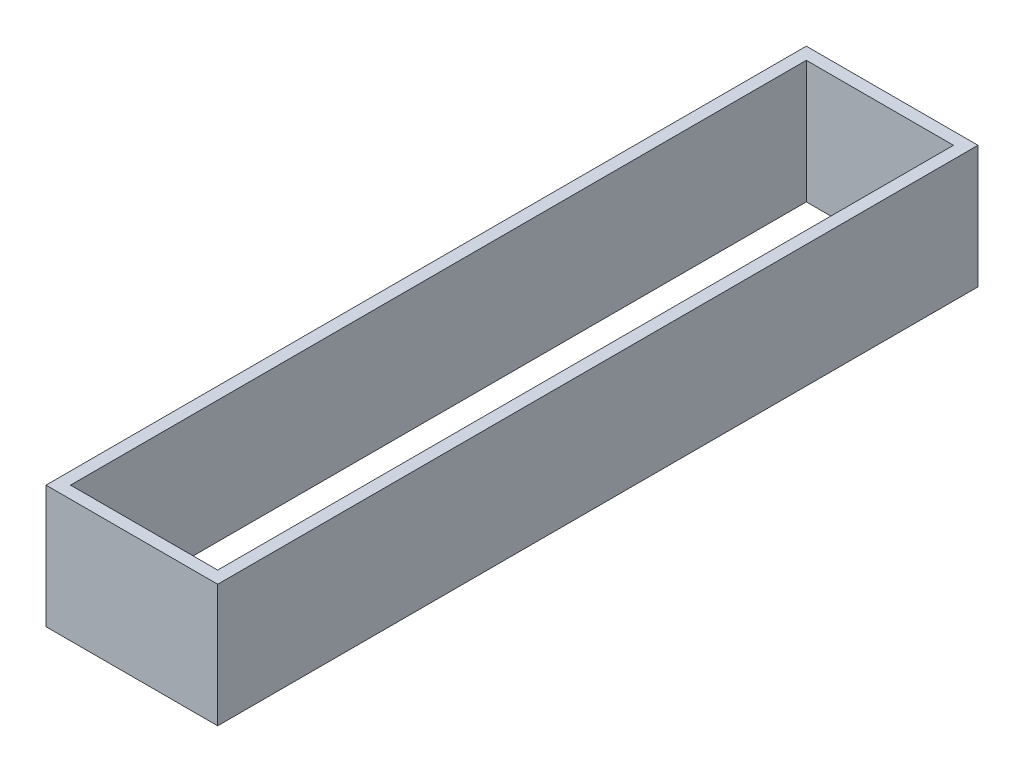
ISO-10303-21;
HEADER;
FILE_DESCRIPTION(('STEP AP214'),'2;1');
FILE_NAME('part.step','',(''),(''),'','','');
FILE_SCHEMA(('AUTOMOTIVE_DESIGN { 1 0 10303 214 1 1 1 1 }'));
ENDSEC;
DATA;
#1=APPLICATION_CONTEXT('core data for automotive mechanical design processes');
#2=APPLICATION_PROTOCOL_DEFINITION('international standard','automotive_design',2000,#1);
#3=PRODUCT_CONTEXT('',#1,'mechanical');
#4=PRODUCT('Part','Part','',(#3));
#5=PRODUCT_RELATED_PRODUCT_CATEGORY('part','',(#4));
#6=PRODUCT_DEFINITION_FORMATION('','',#4);
#7=PRODUCT_DEFINITION_CONTEXT('part definition',#1,'design');
#8=PRODUCT_DEFINITION('design','',#6,#7);
#9=PRODUCT_DEFINITION_SHAPE('','',#8);
#10=(LENGTH_UNIT() NAMED_UNIT(*) SI_UNIT(.MILLI.,.METRE.));
#11=(NAMED_UNIT(*) PLANE_ANGLE_UNIT() SI_UNIT($,.RADIAN.));
#12=(NAMED_UNIT(*) SI_UNIT($,.STERADIAN.) SOLID_ANGLE_UNIT());
#13=UNCERTAINTY_MEASURE_WITH_UNIT(LENGTH_MEASURE(1.E-05),#10,'distance_accuracy_value','');
#14=(GEOMETRIC_REPRESENTATION_CONTEXT(3) GLOBAL_UNCERTAINTY_ASSIGNED_CONTEXT((#13)) GLOBAL_UNIT_ASSIGNED_CONTEXT((#10,
#11,#12)) REPRESENTATION_CONTEXT('',''));
#15=CARTESIAN_POINT('',(0.,0.,0.));
#16=DIRECTION('',(0.,0.,1.));
#17=DIRECTION('',(1.,0.,0.));
#18=AXIS2_PLACEMENT_3D('',#15,#16,#17);
#19=CARTESIAN_POINT('',(0.,5.,6.588));
#20=DIRECTION('',(0.,0.,-1.));
#21=DIRECTION('',(-1.,0.,0.));
#22=AXIS2_PLACEMENT_3D('',#19,#20,#21);
#23=PLANE('',#22);
#24=DIRECTION('',(1.,0.,0.));
#25=VECTOR('',#24,1.);
#26=CARTESIAN_POINT('',(0.,0.,6.588));
#27=LINE('',#26,#25);
#28=CARTESIAN_POINT('',(-9.47599999999999,0.,6.588));
#29=VERTEX_POINT('',#28);
#30=CARTESIAN_POINT('',(-2.47599999999999,0.,6.588));
#31=VERTEX_POINT('',#30);
#32=EDGE_CURVE('E144',#29,#31,#27,.T.);
#33=ORIENTED_EDGE('',*,*,#32,.T.);
#34=DIRECTION('',(0.,-1.,0.));
#35=VECTOR('',#34,1.);
#36=CARTESIAN_POINT('',(-2.47599999999999,5.,6.588));
#37=LINE('',#36,#35);
#38=CARTESIAN_POINT('',(-2.47599999999999,5.,6.588));
#39=VERTEX_POINT('',#38);
#40=EDGE_CURVE('E11',#39,#31,#37,.T.);
#41=ORIENTED_EDGE('',*,*,#40,.F.);
#42=DIRECTION('',(1.,0.,0.));
#43=VECTOR('',#42,1.);
#44=CARTESIAN_POINT('',(0.,5.,6.588));
#45=LINE('',#44,#43);
#46=CARTESIAN_POINT('',(-9.47599999999999,5.,6.588));
#47=VERTEX_POINT('',#46);
#48=EDGE_CURVE('E115',#47,#39,#45,.T.);
#49=ORIENTED_EDGE('',*,*,#48,.F.);
#50=DIRECTION('',(0.,-1.,0.));
#51=VECTOR('',#50,1.);
#52=CARTESIAN_POINT('',(-9.47599999999999,5.,6.588));
#53=LINE('',#52,#51);
#54=EDGE_CURVE('E54',#47,#29,#53,.T.);
#55=ORIENTED_EDGE('',*,*,#54,.T.);
#56=EDGE_LOOP('',(#33,#41,#49,#55));
#57=FACE_BOUND('',#56,.T.);
#58=ADVANCED_FACE('F35',(#57),#23,.F.);
#59=CARTESIAN_POINT('',(-2.47599999999999,5.,0.));
#60=DIRECTION('',(-1.,0.,0.));
#61=DIRECTION('',(0.,0.,1.));
#62=AXIS2_PLACEMENT_3D('',#59,#60,#61);
#63=PLANE('',#62);
#64=DIRECTION('',(0.,0.,-1.));
#65=VECTOR('',#64,1.);
#66=CARTESIAN_POINT('',(-2.47599999999999,0.,0.));
#67=LINE('',#66,#65);
#68=CARTESIAN_POINT('',(-2.47599999999999,0.,-24.412));
#69=VERTEX_POINT('',#68);
#70=EDGE_CURVE('E121',#31,#69,#67,.T.);
#71=ORIENTED_EDGE('',*,*,#70,.T.);
#72=DIRECTION('',(0.,-1.,0.));
#73=VECTOR('',#72,1.);
#74=CARTESIAN_POINT('',(-2.47599999999999,5.,-24.412));
#75=LINE('',#74,#73);
#76=CARTESIAN_POINT('',(-2.47599999999999,5.,-24.412));
#77=VERTEX_POINT('',#76);
#78=EDGE_CURVE('E45',#77,#69,#75,.T.);
#79=ORIENTED_EDGE('',*,*,#78,.F.);
#80=DIRECTION('',(0.,0.,-1.));
#81=VECTOR('',#80,1.);
#82=CARTESIAN_POINT('',(-2.47599999999999,5.,0.));
#83=LINE('',#82,#81);
#84=EDGE_CURVE('E109',#39,#77,#83,.T.);
#85=ORIENTED_EDGE('',*,*,#84,.F.);
#86=ORIENTED_EDGE('',*,*,#40,.T.);
#87=EDGE_LOOP('',(#71,#79,#85,#86));
#88=FACE_BOUND('',#87,.T.);
#89=ADVANCED_FACE('F120',(#88),#63,.F.);
#90=CARTESIAN_POINT('',(0.,5.,-24.412));
#91=DIRECTION('',(0.,0.,-1.));
#92=DIRECTION('',(-1.,0.,0.));
#93=AXIS2_PLACEMENT_3D('',#90,#91,#92);
#94=PLANE('',#93);
#95=DIRECTION('',(1.,0.,0.));
#96=VECTOR('',#95,1.);
#97=CARTESIAN_POINT('',(0.,0.,-24.412));
#98=LINE('',#97,#96);
#99=CARTESIAN_POINT('',(-9.47599999999999,0.,-24.412));
#100=VERTEX_POINT('',#99);
#101=EDGE_CURVE('E147',#100,#69,#98,.T.);
#102=ORIENTED_EDGE('',*,*,#101,.F.);
#103=DIRECTION('',(0.,-1.,0.));
#104=VECTOR('',#103,1.);
#105=CARTESIAN_POINT('',(-9.47599999999999,5.,-24.412));
#106=LINE('',#105,#104);
#107=CARTESIAN_POINT('',(-9.47599999999999,5.,-24.412));
#108=VERTEX_POINT('',#107);
#109=EDGE_CURVE('E80',#108,#100,#106,.T.);
#110=ORIENTED_EDGE('',*,*,#109,.F.);
#111=DIRECTION('',(1.,0.,0.));
#112=VECTOR('',#111,1.);
#113=CARTESIAN_POINT('',(0.,5.,-24.412));
#114=LINE('',#113,#112);
#115=EDGE_CURVE('E114',#108,#77,#114,.T.);
#116=ORIENTED_EDGE('',*,*,#115,.T.);
#117=ORIENTED_EDGE('',*,*,#78,.T.);
#118=EDGE_LOOP('',(#102,#110,#116,#117));
#119=FACE_BOUND('',#118,.T.);
#120=ADVANCED_FACE('F125',(#119),#94,.T.);
#121=CARTESIAN_POINT('',(0.,5.,-23.912));
#122=DIRECTION('',(0.,0.,-1.));
#123=DIRECTION('',(-1.,0.,0.));
#124=AXIS2_PLACEMENT_3D('',#121,#122,#123);
#125=PLANE('',#124);
#126=DIRECTION('',(1.,0.,0.));
#127=VECTOR('',#126,1.);
#128=CARTESIAN_POINT('',(0.,0.,-23.912));
#129=LINE('',#128,#127);
#130=CARTESIAN_POINT('',(-8.97599999999999,0.,-23.912));
#131=VERTEX_POINT('',#130);
#132=CARTESIAN_POINT('',(-2.97599999999999,0.,-23.912));
#133=VERTEX_POINT('',#132);
#134=EDGE_CURVE('E132',#131,#133,#129,.T.);
#135=ORIENTED_EDGE('',*,*,#134,.T.);
#136=DIRECTION('',(0.,-1.,0.));
#137=VECTOR('',#136,1.);
#138=CARTESIAN_POINT('',(-2.97599999999999,5.,-23.912));
#139=LINE('',#138,#137);
#140=CARTESIAN_POINT('',(-2.97599999999999,5.,-23.912));
#141=VERTEX_POINT('',#140);
#142=EDGE_CURVE('E39',#141,#133,#139,.T.);
#143=ORIENTED_EDGE('',*,*,#142,.F.);
#144=DIRECTION('',(1.,0.,0.));
#145=VECTOR('',#144,1.);
#146=CARTESIAN_POINT('',(0.,5.,-23.912));
#147=LINE('',#146,#145);
#148=CARTESIAN_POINT('',(-8.97599999999999,5.,-23.912));
#149=VERTEX_POINT('',#148);
#150=EDGE_CURVE('E152',#149,#141,#147,.T.);
#151=ORIENTED_EDGE('',*,*,#150,.F.);
#152=DIRECTION('',(0.,-1.,0.));
#153=VECTOR('',#152,1.);
#154=CARTESIAN_POINT('',(-8.97599999999999,5.,-23.912));
#155=LINE('',#154,#153);
#156=EDGE_CURVE('E128',#149,#131,#155,.T.);
#157=ORIENTED_EDGE('',*,*,#156,.T.);
#158=EDGE_LOOP('',(#135,#143,#151,#157));
#159=FACE_BOUND('',#158,.T.);
#160=ADVANCED_FACE('F37',(#159),#125,.F.);
#161=CARTESIAN_POINT('',(-2.97599999999999,5.,0.));
#162=DIRECTION('',(1.,0.,0.));
#163=DIRECTION('',(0.,0.,-1.));
#164=AXIS2_PLACEMENT_3D('',#161,#162,#163);
#165=PLANE('',#164);
#166=DIRECTION('',(0.,0.,1.));
#167=VECTOR('',#166,1.);
#168=CARTESIAN_POINT('',(-2.97599999999999,0.,0.));
#169=LINE('',#168,#167);
#170=CARTESIAN_POINT('',(-2.97599999999999,0.,6.088));
#171=VERTEX_POINT('',#170);
#172=EDGE_CURVE('E135',#133,#171,#169,.T.);
#173=ORIENTED_EDGE('',*,*,#172,.T.);
#174=DIRECTION('',(0.,-1.,0.));
#175=VECTOR('',#174,1.);
#176=CARTESIAN_POINT('',(-2.97599999999999,5.,6.088));
#177=LINE('',#176,#175);
#178=CARTESIAN_POINT('',(-2.97599999999999,5.,6.088));
#179=VERTEX_POINT('',#178);
#180=EDGE_CURVE('E157',#179,#171,#177,.T.);
#181=ORIENTED_EDGE('',*,*,#180,.F.);
#182=DIRECTION('',(0.,0.,1.));
#183=VECTOR('',#182,1.);
#184=CARTESIAN_POINT('',(-2.97599999999999,5.,0.));
#185=LINE('',#184,#183);
#186=EDGE_CURVE('E93',#141,#179,#185,.T.);
#187=ORIENTED_EDGE('',*,*,#186,.F.);
#188=ORIENTED_EDGE('',*,*,#142,.T.);
#189=EDGE_LOOP('',(#173,#181,#187,#188));
#190=FACE_BOUND('',#189,.T.);
#191=ADVANCED_FACE('F162',(#190),#165,.F.);
#192=CARTESIAN_POINT('',(0.,5.,6.088));
#193=DIRECTION('',(0.,0.,-1.));
#194=DIRECTION('',(-1.,0.,0.));
#195=AXIS2_PLACEMENT_3D('',#192,#193,#194);
#196=PLANE('',#195);
#197=DIRECTION('',(1.,0.,0.));
#198=VECTOR('',#197,1.);
#199=CARTESIAN_POINT('',(0.,0.,6.088));
#200=LINE('',#199,#198);
#201=CARTESIAN_POINT('',(-8.97599999999999,0.,6.088));
#202=VERTEX_POINT('',#201);
#203=EDGE_CURVE('E138',#202,#171,#200,.T.);
#204=ORIENTED_EDGE('',*,*,#203,.F.);
#205=DIRECTION('',(0.,-1.,0.));
#206=VECTOR('',#205,1.);
#207=CARTESIAN_POINT('',(-8.97599999999999,5.,6.088));
#208=LINE('',#207,#206);
#209=CARTESIAN_POINT('',(-8.97599999999999,5.,6.088));
#210=VERTEX_POINT('',#209);
#211=EDGE_CURVE('E156',#210,#202,#208,.T.);
#212=ORIENTED_EDGE('',*,*,#211,.F.);
#213=DIRECTION('',(1.,0.,0.));
#214=VECTOR('',#213,1.);
#215=CARTESIAN_POINT('',(0.,5.,6.088));
#216=LINE('',#215,#214);
#217=EDGE_CURVE('E203',#210,#179,#216,.T.);
#218=ORIENTED_EDGE('',*,*,#217,.T.);
#219=ORIENTED_EDGE('',*,*,#180,.T.);
#220=EDGE_LOOP('',(#204,#212,#218,#219));
#221=FACE_BOUND('',#220,.T.);
#222=ADVANCED_FACE('F176',(#221),#196,.T.);
#223=CARTESIAN_POINT('',(-8.97599999999999,5.,0.));
#224=DIRECTION('',(1.,0.,0.));
#225=DIRECTION('',(0.,0.,-1.));
#226=AXIS2_PLACEMENT_3D('',#223,#224,#225);
#227=PLANE('',#226);
#228=DIRECTION('',(0.,0.,1.));
#229=VECTOR('',#228,1.);
#230=CARTESIAN_POINT('',(-8.97599999999999,0.,0.));
#231=LINE('',#230,#229);
#232=EDGE_CURVE('E141',#131,#202,#231,.T.);
#233=ORIENTED_EDGE('',*,*,#232,.F.);
#234=ORIENTED_EDGE('',*,*,#156,.F.);
#235=DIRECTION('',(0.,0.,1.));
#236=VECTOR('',#235,1.);
#237=CARTESIAN_POINT('',(-8.97599999999999,5.,0.));
#238=LINE('',#237,#236);
#239=EDGE_CURVE('E174',#149,#210,#238,.T.);
#240=ORIENTED_EDGE('',*,*,#239,.T.);
#241=ORIENTED_EDGE('',*,*,#211,.T.);
#242=EDGE_LOOP('',(#233,#234,#240,#241));
#243=FACE_BOUND('',#242,.T.);
#244=ADVANCED_FACE('F171',(#243),#227,.T.);
#245=CARTESIAN_POINT('',(-9.47599999999999,5.,0.));
#246=DIRECTION('',(-1.,0.,0.));
#247=DIRECTION('',(0.,0.,1.));
#248=AXIS2_PLACEMENT_3D('',#245,#246,#247);
#249=PLANE('',#248);
#250=DIRECTION('',(0.,0.,-1.));
#251=VECTOR('',#250,1.);
#252=CARTESIAN_POINT('',(-9.47599999999999,0.,0.));
#253=LINE('',#252,#251);
#254=EDGE_CURVE('E149',#29,#100,#253,.T.);
#255=ORIENTED_EDGE('',*,*,#254,.F.);
#256=ORIENTED_EDGE('',*,*,#54,.F.);
#257=DIRECTION('',(0.,0.,-1.));
#258=VECTOR('',#257,1.);
#259=CARTESIAN_POINT('',(-9.47599999999999,5.,0.));
#260=LINE('',#259,#258);
#261=EDGE_CURVE('E126',#47,#108,#260,.T.);
#262=ORIENTED_EDGE('',*,*,#261,.T.);
#263=ORIENTED_EDGE('',*,*,#109,.T.);
#264=EDGE_LOOP('',(#255,#256,#262,#263));
#265=FACE_BOUND('',#264,.T.);
#266=ADVANCED_FACE('F183',(#265),#249,.T.);
#267=CARTESIAN_POINT('',(0.,5.,0.));
#268=DIRECTION('',(0.,1.,0.));
#269=DIRECTION('',(0.,0.,1.));
#270=AXIS2_PLACEMENT_3D('',#267,#268,#269);
#271=PLANE('',#270);
#272=ORIENTED_EDGE('',*,*,#150,.T.);
#273=ORIENTED_EDGE('',*,*,#186,.T.);
#274=ORIENTED_EDGE('',*,*,#217,.F.);
#275=ORIENTED_EDGE('',*,*,#239,.F.);
#276=EDGE_LOOP('',(#272,#273,#274,#275));
#277=FACE_BOUND('',#276,.T.);
#278=ORIENTED_EDGE('',*,*,#48,.T.);
#279=ORIENTED_EDGE('',*,*,#84,.T.);
#280=ORIENTED_EDGE('',*,*,#115,.F.);
#281=ORIENTED_EDGE('',*,*,#261,.F.);
#282=EDGE_LOOP('',(#278,#279,#280,#281));
#283=FACE_BOUND('',#282,.T.);
#284=ADVANCED_FACE('F111',(#277,#283),#271,.T.);
#285=CARTESIAN_POINT('',(0.,0.,0.));
#286=DIRECTION('',(0.,1.,0.));
#287=DIRECTION('',(0.,0.,1.));
#288=AXIS2_PLACEMENT_3D('',#285,#286,#287);
#289=PLANE('',#288);
#290=ORIENTED_EDGE('',*,*,#134,.F.);
#291=ORIENTED_EDGE('',*,*,#232,.T.);
#292=ORIENTED_EDGE('',*,*,#203,.T.);
#293=ORIENTED_EDGE('',*,*,#172,.F.);
#294=EDGE_LOOP('',(#290,#291,#292,#293));
#295=FACE_BOUND('',#294,.T.);
#296=ORIENTED_EDGE('',*,*,#32,.F.);
#297=ORIENTED_EDGE('',*,*,#254,.T.);
#298=ORIENTED_EDGE('',*,*,#101,.T.);
#299=ORIENTED_EDGE('',*,*,#70,.F.);
#300=EDGE_LOOP('',(#296,#297,#298,#299));
#301=FACE_BOUND('',#300,.T.);
#302=ADVANCED_FACE('F168',(#295,#301),#289,.F.);
#303=CLOSED_SHELL('',(#58,#89,#120,#160,#191,#222,#244,#266,#284,#302));
#304=MANIFOLD_SOLID_BREP('B2',#303);
#305=ADVANCED_BREP_SHAPE_REPRESENTATION('',(#18,#304),#14);
#306=SHAPE_DEFINITION_REPRESENTATION(#9,#305);
ENDSEC;
END-ISO-10303-21;
